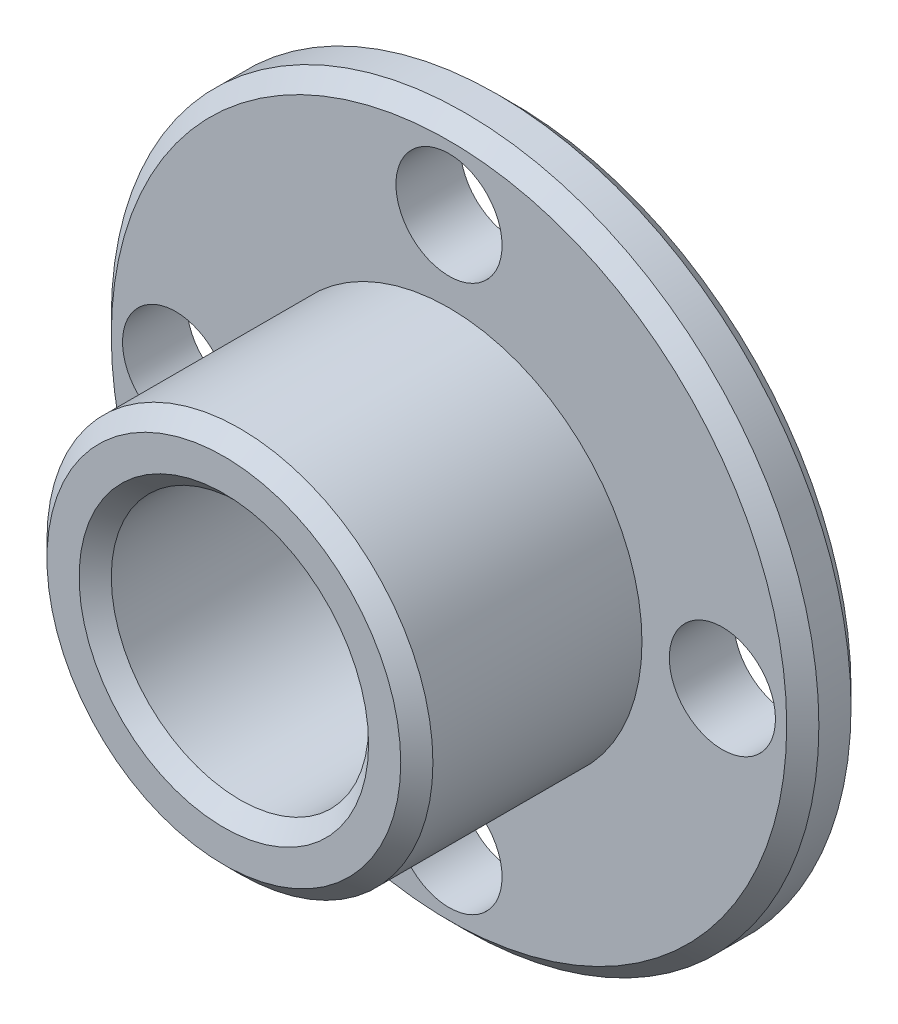
ISO-10303-21;
HEADER;
FILE_DESCRIPTION(('STEP AP214'),'2;1');
FILE_NAME('part.step','',(''),(''),'','','');
FILE_SCHEMA(('AUTOMOTIVE_DESIGN { 1 0 10303 214 1 1 1 1 }'));
ENDSEC;
DATA;
#1=APPLICATION_CONTEXT('core data for automotive mechanical design processes');
#2=APPLICATION_PROTOCOL_DEFINITION('international standard','automotive_design',2000,#1);
#3=PRODUCT_CONTEXT('',#1,'mechanical');
#4=PRODUCT('Part','Part','',(#3));
#5=PRODUCT_RELATED_PRODUCT_CATEGORY('part','',(#4));
#6=PRODUCT_DEFINITION_FORMATION('','',#4);
#7=PRODUCT_DEFINITION_CONTEXT('part definition',#1,'design');
#8=PRODUCT_DEFINITION('design','',#6,#7);
#9=PRODUCT_DEFINITION_SHAPE('','',#8);
#10=(LENGTH_UNIT() NAMED_UNIT(*) SI_UNIT(.MILLI.,.METRE.));
#11=(NAMED_UNIT(*) PLANE_ANGLE_UNIT() SI_UNIT($,.RADIAN.));
#12=(NAMED_UNIT(*) SI_UNIT($,.STERADIAN.) SOLID_ANGLE_UNIT());
#13=UNCERTAINTY_MEASURE_WITH_UNIT(LENGTH_MEASURE(1.E-05),#10,'distance_accuracy_value','');
#14=(GEOMETRIC_REPRESENTATION_CONTEXT(3) GLOBAL_UNCERTAINTY_ASSIGNED_CONTEXT((#13)) GLOBAL_UNIT_ASSIGNED_CONTEXT((#10,
#11,#12)) REPRESENTATION_CONTEXT('',''));
#15=CARTESIAN_POINT('',(0.,0.,0.));
#16=DIRECTION('',(0.,0.,1.));
#17=DIRECTION('',(1.,0.,0.));
#18=AXIS2_PLACEMENT_3D('',#15,#16,#17);
#19=CARTESIAN_POINT('',(65.667939740338,39.5358176550185,2.));
#20=DIRECTION('',(0.,0.,1.));
#21=DIRECTION('',(1.,0.,0.));
#22=AXIS2_PLACEMENT_3D('',#19,#20,#21);
#23=PLANE('',#22);
#24=CARTESIAN_POINT('',(65.667939740338,39.5358176550185,2.));
#25=DIRECTION('',(0.,0.,1.));
#26=DIRECTION('',(1.,0.,0.));
#27=AXIS2_PLACEMENT_3D('',#24,#25,#26);
#28=CIRCLE('',#27,10.4999999999999);
#29=CARTESIAN_POINT('',(76.1679397403379,39.5358176550185,2.));
#30=VERTEX_POINT('',#29);
#31=EDGE_CURVE('E56',#30,#30,#28,.T.);
#32=ORIENTED_EDGE('',*,*,#31,.T.);
#33=EDGE_LOOP('',(#32));
#34=FACE_BOUND('',#33,.T.);
#35=CARTESIAN_POINT('',(57.167939740338,39.5358176550185,2.));
#36=DIRECTION('',(0.,0.,1.));
#37=DIRECTION('',(1.,0.,0.));
#38=AXIS2_PLACEMENT_3D('',#35,#36,#37);
#39=CIRCLE('',#38,1.65);
#40=CARTESIAN_POINT('',(58.817939740338,39.5358176550185,2.));
#41=VERTEX_POINT('',#40);
#42=EDGE_CURVE('E87',#41,#41,#39,.T.);
#43=ORIENTED_EDGE('',*,*,#42,.F.);
#44=EDGE_LOOP('',(#43));
#45=FACE_BOUND('',#44,.T.);
#46=CARTESIAN_POINT('',(74.1679397403379,39.5358176550185,2.));
#47=DIRECTION('',(0.,0.,1.));
#48=DIRECTION('',(1.,0.,0.));
#49=AXIS2_PLACEMENT_3D('',#46,#47,#48);
#50=CIRCLE('',#49,1.65000000000002);
#51=CARTESIAN_POINT('',(75.817939740338,39.5358176550185,2.));
#52=VERTEX_POINT('',#51);
#53=EDGE_CURVE('E75',#52,#52,#50,.T.);
#54=ORIENTED_EDGE('',*,*,#53,.F.);
#55=EDGE_LOOP('',(#54));
#56=FACE_BOUND('',#55,.T.);
#57=CARTESIAN_POINT('',(65.667939740338,48.0358176550185,2.));
#58=DIRECTION('',(0.,0.,1.));
#59=DIRECTION('',(1.,0.,0.));
#60=AXIS2_PLACEMENT_3D('',#57,#58,#59);
#61=CIRCLE('',#60,1.65);
#62=CARTESIAN_POINT('',(67.317939740338,48.0358176550185,2.));
#63=VERTEX_POINT('',#62);
#64=EDGE_CURVE('E71',#63,#63,#61,.T.);
#65=ORIENTED_EDGE('',*,*,#64,.F.);
#66=EDGE_LOOP('',(#65));
#67=FACE_BOUND('',#66,.T.);
#68=CARTESIAN_POINT('',(65.6679397403379,31.0358176550185,2.));
#69=DIRECTION('',(0.,0.,1.));
#70=DIRECTION('',(1.,0.,0.));
#71=AXIS2_PLACEMENT_3D('',#68,#69,#70);
#72=CIRCLE('',#71,1.65000000000002);
#73=CARTESIAN_POINT('',(67.3179397403379,31.0358176550185,2.));
#74=VERTEX_POINT('',#73);
#75=EDGE_CURVE('E81',#74,#74,#72,.T.);
#76=ORIENTED_EDGE('',*,*,#75,.F.);
#77=EDGE_LOOP('',(#76));
#78=FACE_BOUND('',#77,.T.);
#79=CARTESIAN_POINT('',(65.667939740338,39.5358176550185,2.));
#80=DIRECTION('',(0.,0.,1.));
#81=DIRECTION('',(1.,0.,0.));
#82=AXIS2_PLACEMENT_3D('',#79,#80,#81);
#83=CIRCLE('',#82,6.);
#84=CARTESIAN_POINT('',(71.667939740338,39.5358176550185,2.));
#85=VERTEX_POINT('',#84);
#86=EDGE_CURVE('E93',#85,#85,#83,.T.);
#87=ORIENTED_EDGE('',*,*,#86,.F.);
#88=EDGE_LOOP('',(#87));
#89=FACE_BOUND('',#88,.T.);
#90=ADVANCED_FACE('F35',(#34,#45,#56,#67,#78,#89),#23,.T.);
#91=CARTESIAN_POINT('',(65.667939740338,39.5358176550185,0.));
#92=DIRECTION('',(0.,0.,1.));
#93=DIRECTION('',(1.,0.,0.));
#94=AXIS2_PLACEMENT_3D('',#91,#92,#93);
#95=PLANE('',#94);
#96=CARTESIAN_POINT('',(65.667939740338,39.5358176550185,0.));
#97=DIRECTION('',(0.,0.,1.));
#98=DIRECTION('',(1.,0.,0.));
#99=AXIS2_PLACEMENT_3D('',#96,#97,#98);
#100=CIRCLE('',#99,10.4999999999999);
#101=CARTESIAN_POINT('',(76.1679397403379,39.5358176550185,0.));
#102=VERTEX_POINT('',#101);
#103=EDGE_CURVE('E59',#102,#102,#100,.F.);
#104=ORIENTED_EDGE('',*,*,#103,.T.);
#105=EDGE_LOOP('',(#104));
#106=FACE_BOUND('',#105,.T.);
#107=CARTESIAN_POINT('',(65.667939740338,39.5358176550185,0.));
#108=DIRECTION('',(0.,0.,1.));
#109=DIRECTION('',(1.,0.,0.));
#110=AXIS2_PLACEMENT_3D('',#107,#108,#109);
#111=CIRCLE('',#110,4.00000000000005);
#112=CARTESIAN_POINT('',(69.667939740338,39.5358176550185,0.));
#113=VERTEX_POINT('',#112);
#114=EDGE_CURVE('E68',#113,#113,#111,.T.);
#115=ORIENTED_EDGE('',*,*,#114,.T.);
#116=EDGE_LOOP('',(#115));
#117=FACE_BOUND('',#116,.T.);
#118=CARTESIAN_POINT('',(65.667939740338,48.0358176550185,0.));
#119=DIRECTION('',(0.,0.,1.));
#120=DIRECTION('',(1.,0.,0.));
#121=AXIS2_PLACEMENT_3D('',#118,#119,#120);
#122=CIRCLE('',#121,1.65);
#123=CARTESIAN_POINT('',(67.317939740338,48.0358176550185,0.));
#124=VERTEX_POINT('',#123);
#125=EDGE_CURVE('E72',#124,#124,#122,.T.);
#126=ORIENTED_EDGE('',*,*,#125,.T.);
#127=EDGE_LOOP('',(#126));
#128=FACE_BOUND('',#127,.T.);
#129=CARTESIAN_POINT('',(74.1679397403379,39.5358176550185,0.));
#130=DIRECTION('',(0.,0.,1.));
#131=DIRECTION('',(1.,0.,0.));
#132=AXIS2_PLACEMENT_3D('',#129,#130,#131);
#133=CIRCLE('',#132,1.65000000000002);
#134=CARTESIAN_POINT('',(75.817939740338,39.5358176550185,0.));
#135=VERTEX_POINT('',#134);
#136=EDGE_CURVE('E78',#135,#135,#133,.T.);
#137=ORIENTED_EDGE('',*,*,#136,.T.);
#138=EDGE_LOOP('',(#137));
#139=FACE_BOUND('',#138,.T.);
#140=CARTESIAN_POINT('',(65.6679397403379,31.0358176550185,0.));
#141=DIRECTION('',(0.,0.,1.));
#142=DIRECTION('',(1.,0.,0.));
#143=AXIS2_PLACEMENT_3D('',#140,#141,#142);
#144=CIRCLE('',#143,1.65000000000002);
#145=CARTESIAN_POINT('',(67.3179397403379,31.0358176550185,0.));
#146=VERTEX_POINT('',#145);
#147=EDGE_CURVE('E84',#146,#146,#144,.T.);
#148=ORIENTED_EDGE('',*,*,#147,.T.);
#149=EDGE_LOOP('',(#148));
#150=FACE_BOUND('',#149,.T.);
#151=CARTESIAN_POINT('',(57.167939740338,39.5358176550185,0.));
#152=DIRECTION('',(0.,0.,1.));
#153=DIRECTION('',(1.,0.,0.));
#154=AXIS2_PLACEMENT_3D('',#151,#152,#153);
#155=CIRCLE('',#154,1.65);
#156=CARTESIAN_POINT('',(58.817939740338,39.5358176550185,0.));
#157=VERTEX_POINT('',#156);
#158=EDGE_CURVE('E90',#157,#157,#155,.T.);
#159=ORIENTED_EDGE('',*,*,#158,.T.);
#160=EDGE_LOOP('',(#159));
#161=FACE_BOUND('',#160,.T.);
#162=ADVANCED_FACE('F102',(#106,#117,#128,#139,#150,#161),#95,.F.);
#163=CARTESIAN_POINT('',(65.667939740338,39.5358176550185,2.));
#164=DIRECTION('',(0.,0.,-1.));
#165=DIRECTION('',(-1.,0.,0.));
#166=AXIS2_PLACEMENT_3D('',#163,#164,#165);
#167=CYLINDRICAL_SURFACE('',#166,10.9999999999999);
#168=CARTESIAN_POINT('',(65.667939740338,39.5358176550185,0.500000000000002));
#169=DIRECTION('',(0.,0.,1.));
#170=DIRECTION('',(1.,0.,0.));
#171=AXIS2_PLACEMENT_3D('',#168,#169,#170);
#172=CIRCLE('',#171,10.9999999999999);
#173=CARTESIAN_POINT('',(76.6679397403379,39.5358176550185,0.500000000000002));
#174=VERTEX_POINT('',#173);
#175=EDGE_CURVE('E62',#174,#174,#172,.T.);
#176=ORIENTED_EDGE('',*,*,#175,.T.);
#177=EDGE_LOOP('',(#176));
#178=FACE_BOUND('',#177,.T.);
#179=CARTESIAN_POINT('',(65.667939740338,39.5358176550185,1.5));
#180=DIRECTION('',(0.,0.,1.));
#181=DIRECTION('',(1.,0.,0.));
#182=AXIS2_PLACEMENT_3D('',#179,#180,#181);
#183=CIRCLE('',#182,10.9999999999999);
#184=CARTESIAN_POINT('',(76.6679397403379,39.5358176550185,1.5));
#185=VERTEX_POINT('',#184);
#186=EDGE_CURVE('E65',#185,#185,#183,.F.);
#187=ORIENTED_EDGE('',*,*,#186,.T.);
#188=EDGE_LOOP('',(#187));
#189=FACE_BOUND('',#188,.T.);
#190=ADVANCED_FACE('F108',(#178,#189),#167,.T.);
#191=CARTESIAN_POINT('',(65.667939740338,39.5358176550185,2.));
#192=DIRECTION('',(0.,0.,-1.));
#193=DIRECTION('',(-1.,0.,0.));
#194=AXIS2_PLACEMENT_3D('',#191,#192,#193);
#195=CYLINDRICAL_SURFACE('',#194,4.00000000000005);
#196=CARTESIAN_POINT('',(65.667939740338,39.5358176550185,8.5));
#197=DIRECTION('',(0.,0.,1.));
#198=DIRECTION('',(1.,0.,0.));
#199=AXIS2_PLACEMENT_3D('',#196,#197,#198);
#200=CIRCLE('',#199,4.00000000000005);
#201=CARTESIAN_POINT('',(69.667939740338,39.5358176550185,8.5));
#202=VERTEX_POINT('',#201);
#203=EDGE_CURVE('E10',#202,#202,#200,.T.);
#204=ORIENTED_EDGE('',*,*,#203,.T.);
#205=EDGE_LOOP('',(#204));
#206=FACE_BOUND('',#205,.T.);
#207=ORIENTED_EDGE('',*,*,#114,.F.);
#208=EDGE_LOOP('',(#207));
#209=FACE_BOUND('',#208,.T.);
#210=ADVANCED_FACE('F113',(#206,#209),#195,.F.);
#211=CARTESIAN_POINT('',(65.667939740338,48.0358176550185,2.));
#212=DIRECTION('',(0.,0.,-1.));
#213=DIRECTION('',(-1.,0.,0.));
#214=AXIS2_PLACEMENT_3D('',#211,#212,#213);
#215=CYLINDRICAL_SURFACE('',#214,1.65);
#216=ORIENTED_EDGE('',*,*,#64,.T.);
#217=EDGE_LOOP('',(#216));
#218=FACE_BOUND('',#217,.T.);
#219=ORIENTED_EDGE('',*,*,#125,.F.);
#220=EDGE_LOOP('',(#219));
#221=FACE_BOUND('',#220,.T.);
#222=ADVANCED_FACE('F166',(#218,#221),#215,.F.);
#223=CARTESIAN_POINT('',(74.1679397403379,39.5358176550185,2.));
#224=DIRECTION('',(0.,0.,-1.));
#225=DIRECTION('',(-1.,0.,0.));
#226=AXIS2_PLACEMENT_3D('',#223,#224,#225);
#227=CYLINDRICAL_SURFACE('',#226,1.65000000000002);
#228=ORIENTED_EDGE('',*,*,#53,.T.);
#229=EDGE_LOOP('',(#228));
#230=FACE_BOUND('',#229,.T.);
#231=ORIENTED_EDGE('',*,*,#136,.F.);
#232=EDGE_LOOP('',(#231));
#233=FACE_BOUND('',#232,.T.);
#234=ADVANCED_FACE('F163',(#230,#233),#227,.F.);
#235=CARTESIAN_POINT('',(65.6679397403379,31.0358176550185,2.));
#236=DIRECTION('',(0.,0.,-1.));
#237=DIRECTION('',(-1.,0.,0.));
#238=AXIS2_PLACEMENT_3D('',#235,#236,#237);
#239=CYLINDRICAL_SURFACE('',#238,1.65000000000002);
#240=ORIENTED_EDGE('',*,*,#75,.T.);
#241=EDGE_LOOP('',(#240));
#242=FACE_BOUND('',#241,.T.);
#243=ORIENTED_EDGE('',*,*,#147,.F.);
#244=EDGE_LOOP('',(#243));
#245=FACE_BOUND('',#244,.T.);
#246=ADVANCED_FACE('F157',(#242,#245),#239,.F.);
#247=CARTESIAN_POINT('',(57.167939740338,39.5358176550185,2.));
#248=DIRECTION('',(0.,0.,-1.));
#249=DIRECTION('',(-1.,0.,0.));
#250=AXIS2_PLACEMENT_3D('',#247,#248,#249);
#251=CYLINDRICAL_SURFACE('',#250,1.65);
#252=ORIENTED_EDGE('',*,*,#42,.T.);
#253=EDGE_LOOP('',(#252));
#254=FACE_BOUND('',#253,.T.);
#255=ORIENTED_EDGE('',*,*,#158,.F.);
#256=EDGE_LOOP('',(#255));
#257=FACE_BOUND('',#256,.T.);
#258=ADVANCED_FACE('F148',(#254,#257),#251,.F.);
#259=CARTESIAN_POINT('',(65.667939740338,39.5358176550185,9.));
#260=DIRECTION('',(0.,0.,1.));
#261=DIRECTION('',(1.,0.,0.));
#262=AXIS2_PLACEMENT_3D('',#259,#260,#261);
#263=PLANE('',#262);
#264=CARTESIAN_POINT('',(65.667939740338,39.5358176550185,9.));
#265=DIRECTION('',(0.,0.,1.));
#266=DIRECTION('',(1.,0.,0.));
#267=AXIS2_PLACEMENT_3D('',#264,#265,#266);
#268=CIRCLE('',#267,5.50000000000001);
#269=CARTESIAN_POINT('',(71.167939740338,39.5358176550185,9.));
#270=VERTEX_POINT('',#269);
#271=EDGE_CURVE('E47',#270,#270,#268,.T.);
#272=ORIENTED_EDGE('',*,*,#271,.T.);
#273=EDGE_LOOP('',(#272));
#274=FACE_BOUND('',#273,.T.);
#275=CARTESIAN_POINT('',(65.667939740338,39.5358176550185,9.));
#276=DIRECTION('',(0.,0.,1.));
#277=DIRECTION('',(1.,0.,0.));
#278=AXIS2_PLACEMENT_3D('',#275,#276,#277);
#279=CIRCLE('',#278,4.50000000000006);
#280=CARTESIAN_POINT('',(70.167939740338,39.5358176550185,9.));
#281=VERTEX_POINT('',#280);
#282=EDGE_CURVE('E51',#281,#281,#279,.F.);
#283=ORIENTED_EDGE('',*,*,#282,.T.);
#284=EDGE_LOOP('',(#283));
#285=FACE_BOUND('',#284,.T.);
#286=ADVANCED_FACE('F145',(#274,#285),#263,.T.);
#287=CARTESIAN_POINT('',(65.667939740338,39.5358176550185,9.));
#288=DIRECTION('',(0.,0.,-1.));
#289=DIRECTION('',(-1.,0.,0.));
#290=AXIS2_PLACEMENT_3D('',#287,#288,#289);
#291=CYLINDRICAL_SURFACE('',#290,6.);
#292=CARTESIAN_POINT('',(65.667939740338,39.5358176550185,8.50000000000001));
#293=DIRECTION('',(0.,0.,1.));
#294=DIRECTION('',(1.,0.,0.));
#295=AXIS2_PLACEMENT_3D('',#292,#293,#294);
#296=CIRCLE('',#295,6.);
#297=CARTESIAN_POINT('',(71.667939740338,39.5358176550185,8.50000000000001));
#298=VERTEX_POINT('',#297);
#299=EDGE_CURVE('E43',#298,#298,#296,.F.);
#300=ORIENTED_EDGE('',*,*,#299,.T.);
#301=EDGE_LOOP('',(#300));
#302=FACE_BOUND('',#301,.T.);
#303=ORIENTED_EDGE('',*,*,#86,.T.);
#304=EDGE_LOOP('',(#303));
#305=FACE_BOUND('',#304,.T.);
#306=ADVANCED_FACE('F99',(#302,#305),#291,.T.);
#307=CARTESIAN_POINT('',(65.667939740338,39.5358176550185,0.500000000000002));
#308=DIRECTION('',(0.,0.,1.));
#309=DIRECTION('',(1.,0.,0.));
#310=AXIS2_PLACEMENT_3D('',#307,#308,#309);
#311=CONICAL_SURFACE('',#310,10.9999999999999,0.785398163397448);
#312=ORIENTED_EDGE('',*,*,#103,.F.);
#313=EDGE_LOOP('',(#312));
#314=FACE_BOUND('',#313,.T.);
#315=ORIENTED_EDGE('',*,*,#175,.F.);
#316=EDGE_LOOP('',(#315));
#317=FACE_BOUND('',#316,.T.);
#318=ADVANCED_FACE('F120',(#314,#317),#311,.T.);
#319=CARTESIAN_POINT('',(65.667939740338,39.5358176550185,2.));
#320=DIRECTION('',(0.,0.,-1.));
#321=DIRECTION('',(-1.,0.,0.));
#322=AXIS2_PLACEMENT_3D('',#319,#320,#321);
#323=CONICAL_SURFACE('',#322,10.4999999999999,0.785398163397459);
#324=ORIENTED_EDGE('',*,*,#186,.F.);
#325=EDGE_LOOP('',(#324));
#326=FACE_BOUND('',#325,.T.);
#327=ORIENTED_EDGE('',*,*,#31,.F.);
#328=EDGE_LOOP('',(#327));
#329=FACE_BOUND('',#328,.T.);
#330=ADVANCED_FACE('F126',(#326,#329),#323,.T.);
#331=CARTESIAN_POINT('',(65.667939740338,39.5358176550185,9.));
#332=DIRECTION('',(0.,0.,-1.));
#333=DIRECTION('',(-1.,0.,0.));
#334=AXIS2_PLACEMENT_3D('',#331,#332,#333);
#335=CONICAL_SURFACE('',#334,5.50000000000001,0.785398163397457);
#336=ORIENTED_EDGE('',*,*,#299,.F.);
#337=EDGE_LOOP('',(#336));
#338=FACE_BOUND('',#337,.T.);
#339=ORIENTED_EDGE('',*,*,#271,.F.);
#340=EDGE_LOOP('',(#339));
#341=FACE_BOUND('',#340,.T.);
#342=ADVANCED_FACE('F132',(#338,#341),#335,.T.);
#343=CARTESIAN_POINT('',(65.667939740338,39.5358176550185,8.5));
#344=DIRECTION('',(0.,0.,1.));
#345=DIRECTION('',(1.,0.,0.));
#346=AXIS2_PLACEMENT_3D('',#343,#344,#345);
#347=CONICAL_SURFACE('',#346,4.00000000000005,0.785398163397455);
#348=ORIENTED_EDGE('',*,*,#282,.F.);
#349=EDGE_LOOP('',(#348));
#350=FACE_BOUND('',#349,.T.);
#351=ORIENTED_EDGE('',*,*,#203,.F.);
#352=EDGE_LOOP('',(#351));
#353=FACE_BOUND('',#352,.T.);
#354=ADVANCED_FACE('F38',(#350,#353),#347,.F.);
#355=CLOSED_SHELL('',(#90,#162,#190,#210,#222,#234,#246,#258,#286,#306,#318,#330,#342,#354));
#356=MANIFOLD_SOLID_BREP('B2',#355);
#357=ADVANCED_BREP_SHAPE_REPRESENTATION('',(#18,#356),#14);
#358=SHAPE_DEFINITION_REPRESENTATION(#9,#357);
ENDSEC;
END-ISO-10303-21;
